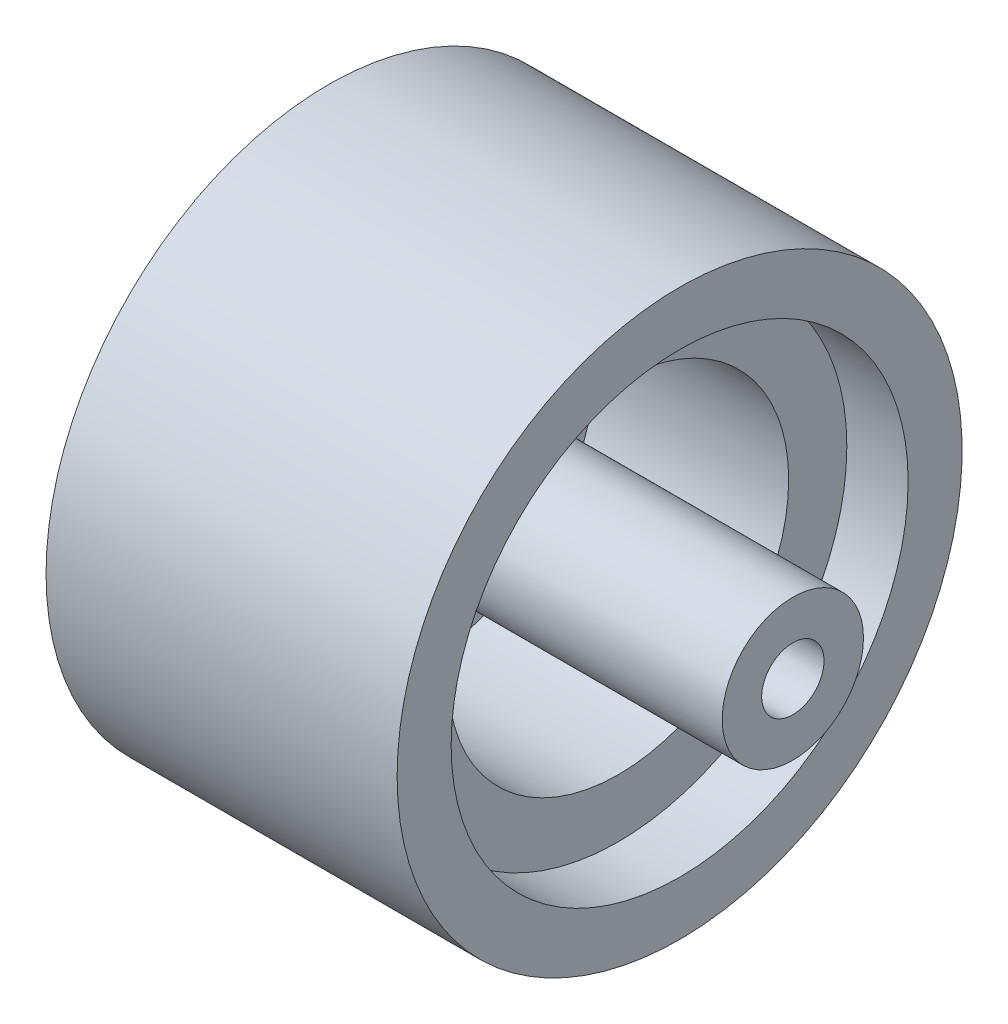
ISO-10303-21;
HEADER;
FILE_DESCRIPTION(('STEP AP214'),'2;1');
FILE_NAME('part.step','',(''),(''),'','','');
FILE_SCHEMA(('AUTOMOTIVE_DESIGN { 1 0 10303 214 1 1 1 1 }'));
ENDSEC;
DATA;
#1=APPLICATION_CONTEXT('core data for automotive mechanical design processes');
#2=APPLICATION_PROTOCOL_DEFINITION('international standard','automotive_design',2000,#1);
#3=PRODUCT_CONTEXT('',#1,'mechanical');
#4=PRODUCT('Part','Part','',(#3));
#5=PRODUCT_RELATED_PRODUCT_CATEGORY('part','',(#4));
#6=PRODUCT_DEFINITION_FORMATION('','',#4);
#7=PRODUCT_DEFINITION_CONTEXT('part definition',#1,'design');
#8=PRODUCT_DEFINITION('design','',#6,#7);
#9=PRODUCT_DEFINITION_SHAPE('','',#8);
#10=(LENGTH_UNIT() NAMED_UNIT(*) SI_UNIT(.MILLI.,.METRE.));
#11=(NAMED_UNIT(*) PLANE_ANGLE_UNIT() SI_UNIT($,.RADIAN.));
#12=(NAMED_UNIT(*) SI_UNIT($,.STERADIAN.) SOLID_ANGLE_UNIT());
#13=UNCERTAINTY_MEASURE_WITH_UNIT(LENGTH_MEASURE(1.E-05),#10,'distance_accuracy_value','');
#14=(GEOMETRIC_REPRESENTATION_CONTEXT(3) GLOBAL_UNCERTAINTY_ASSIGNED_CONTEXT((#13)) GLOBAL_UNIT_ASSIGNED_CONTEXT((#10,
#11,#12)) REPRESENTATION_CONTEXT('',''));
#15=CARTESIAN_POINT('',(0.,0.,0.));
#16=DIRECTION('',(0.,0.,1.));
#17=DIRECTION('',(1.,0.,0.));
#18=AXIS2_PLACEMENT_3D('',#15,#16,#17);
#19=CARTESIAN_POINT('',(11.,0.,0.));
#20=DIRECTION('',(1.,0.,0.));
#21=DIRECTION('',(0.,0.,-1.));
#22=AXIS2_PLACEMENT_3D('',#19,#20,#21);
#23=PLANE('',#22);
#24=CARTESIAN_POINT('',(11.,0.,0.));
#25=DIRECTION('',(1.,0.,0.));
#26=DIRECTION('',(0.,0.,-1.));
#27=AXIS2_PLACEMENT_3D('',#24,#25,#26);
#28=CIRCLE('',#27,8.2);
#29=CARTESIAN_POINT('',(11.,0.,-8.2));
#30=VERTEX_POINT('',#29);
#31=EDGE_CURVE('E42',#30,#30,#28,.T.);
#32=ORIENTED_EDGE('',*,*,#31,.F.);
#33=EDGE_LOOP('',(#32));
#34=FACE_BOUND('',#33,.T.);
#35=CARTESIAN_POINT('',(11.,0.,0.));
#36=DIRECTION('',(1.,0.,0.));
#37=DIRECTION('',(0.,0.,-1.));
#38=AXIS2_PLACEMENT_3D('',#35,#36,#37);
#39=CIRCLE('',#38,11.);
#40=CARTESIAN_POINT('',(11.,0.,-11.));
#41=VERTEX_POINT('',#40);
#42=EDGE_CURVE('E60',#41,#41,#39,.F.);
#43=ORIENTED_EDGE('',*,*,#42,.F.);
#44=EDGE_LOOP('',(#43));
#45=FACE_BOUND('',#44,.T.);
#46=ADVANCED_FACE('F31',(#34,#45),#23,.T.);
#47=CARTESIAN_POINT('',(0.,0.,0.));
#48=DIRECTION('',(1.,0.,0.));
#49=DIRECTION('',(0.,0.,-1.));
#50=AXIS2_PLACEMENT_3D('',#47,#48,#49);
#51=PLANE('',#50);
#52=CARTESIAN_POINT('',(0.,0.,0.));
#53=DIRECTION('',(1.,0.,0.));
#54=DIRECTION('',(0.,0.,-1.));
#55=AXIS2_PLACEMENT_3D('',#52,#53,#54);
#56=CIRCLE('',#55,1.5);
#57=CARTESIAN_POINT('',(0.,0.,-1.5));
#58=VERTEX_POINT('',#57);
#59=EDGE_CURVE('E52',#58,#58,#56,.T.);
#60=ORIENTED_EDGE('',*,*,#59,.T.);
#61=EDGE_LOOP('',(#60));
#62=FACE_BOUND('',#61,.T.);
#63=CARTESIAN_POINT('',(0.,0.,0.));
#64=DIRECTION('',(1.,0.,0.));
#65=DIRECTION('',(0.,0.,-1.));
#66=AXIS2_PLACEMENT_3D('',#63,#64,#65);
#67=CIRCLE('',#66,11.);
#68=CARTESIAN_POINT('',(0.,0.,-11.));
#69=VERTEX_POINT('',#68);
#70=EDGE_CURVE('E10',#69,#69,#67,.T.);
#71=ORIENTED_EDGE('',*,*,#70,.F.);
#72=EDGE_LOOP('',(#71));
#73=FACE_BOUND('',#72,.T.);
#74=ADVANCED_FACE('F33',(#62,#73),#51,.F.);
#75=CARTESIAN_POINT('',(1.65,0.,0.));
#76=DIRECTION('',(1.,0.,0.));
#77=DIRECTION('',(0.,0.,-1.));
#78=AXIS2_PLACEMENT_3D('',#75,#76,#77);
#79=CYLINDRICAL_SURFACE('',#78,8.2);
#80=CARTESIAN_POINT('',(1.65,0.,0.));
#81=DIRECTION('',(1.,0.,0.));
#82=DIRECTION('',(0.,0.,-1.));
#83=AXIS2_PLACEMENT_3D('',#80,#81,#82);
#84=CIRCLE('',#83,8.2);
#85=CARTESIAN_POINT('',(1.65,0.,-8.2));
#86=VERTEX_POINT('',#85);
#87=EDGE_CURVE('E38',#86,#86,#84,.T.);
#88=ORIENTED_EDGE('',*,*,#87,.F.);
#89=EDGE_LOOP('',(#88));
#90=FACE_BOUND('',#89,.T.);
#91=ORIENTED_EDGE('',*,*,#31,.T.);
#92=EDGE_LOOP('',(#91));
#93=FACE_BOUND('',#92,.T.);
#94=ADVANCED_FACE('F102',(#90,#93),#79,.F.);
#95=CARTESIAN_POINT('',(1.65,0.,0.));
#96=DIRECTION('',(1.,0.,0.));
#97=DIRECTION('',(0.,0.,-1.));
#98=AXIS2_PLACEMENT_3D('',#95,#96,#97);
#99=PLANE('',#98);
#100=CARTESIAN_POINT('',(1.65,0.,0.));
#101=DIRECTION('',(1.,0.,0.));
#102=DIRECTION('',(0.,0.,-1.));
#103=AXIS2_PLACEMENT_3D('',#100,#101,#102);
#104=CIRCLE('',#103,3.4);
#105=CARTESIAN_POINT('',(1.65,0.,-3.4));
#106=VERTEX_POINT('',#105);
#107=EDGE_CURVE('E49',#106,#106,#104,.T.);
#108=ORIENTED_EDGE('',*,*,#107,.F.);
#109=EDGE_LOOP('',(#108));
#110=FACE_BOUND('',#109,.T.);
#111=ORIENTED_EDGE('',*,*,#87,.T.);
#112=EDGE_LOOP('',(#111));
#113=FACE_BOUND('',#112,.T.);
#114=ADVANCED_FACE('F109',(#110,#113),#99,.T.);
#115=CARTESIAN_POINT('',(19.4,0.,0.));
#116=DIRECTION('',(-1.,0.,0.));
#117=DIRECTION('',(0.,0.,1.));
#118=AXIS2_PLACEMENT_3D('',#115,#116,#117);
#119=CYLINDRICAL_SURFACE('',#118,3.4);
#120=CARTESIAN_POINT('',(19.4,0.,0.));
#121=DIRECTION('',(1.,0.,0.));
#122=DIRECTION('',(0.,0.,-1.));
#123=AXIS2_PLACEMENT_3D('',#120,#121,#122);
#124=CIRCLE('',#123,3.4);
#125=CARTESIAN_POINT('',(19.4,0.,-3.4));
#126=VERTEX_POINT('',#125);
#127=EDGE_CURVE('E47',#126,#126,#124,.T.);
#128=ORIENTED_EDGE('',*,*,#127,.F.);
#129=EDGE_LOOP('',(#128));
#130=FACE_BOUND('',#129,.T.);
#131=ORIENTED_EDGE('',*,*,#107,.T.);
#132=EDGE_LOOP('',(#131));
#133=FACE_BOUND('',#132,.T.);
#134=ADVANCED_FACE('F113',(#130,#133),#119,.T.);
#135=CARTESIAN_POINT('',(19.4,0.,0.));
#136=DIRECTION('',(1.,0.,0.));
#137=DIRECTION('',(0.,0.,-1.));
#138=AXIS2_PLACEMENT_3D('',#135,#136,#137);
#139=PLANE('',#138);
#140=CARTESIAN_POINT('',(19.4,0.,0.));
#141=DIRECTION('',(1.,0.,0.));
#142=DIRECTION('',(0.,0.,-1.));
#143=AXIS2_PLACEMENT_3D('',#140,#141,#142);
#144=CIRCLE('',#143,1.5);
#145=CARTESIAN_POINT('',(19.4,0.,-1.5));
#146=VERTEX_POINT('',#145);
#147=EDGE_CURVE('E57',#146,#146,#144,.T.);
#148=ORIENTED_EDGE('',*,*,#147,.F.);
#149=EDGE_LOOP('',(#148));
#150=FACE_BOUND('',#149,.T.);
#151=ORIENTED_EDGE('',*,*,#127,.T.);
#152=EDGE_LOOP('',(#151));
#153=FACE_BOUND('',#152,.T.);
#154=ADVANCED_FACE('F117',(#150,#153),#139,.T.);
#155=CARTESIAN_POINT('',(-6.35,0.,0.));
#156=DIRECTION('',(1.,0.,0.));
#157=DIRECTION('',(0.,0.,-1.));
#158=AXIS2_PLACEMENT_3D('',#155,#156,#157);
#159=CYLINDRICAL_SURFACE('',#158,1.5);
#160=ORIENTED_EDGE('',*,*,#147,.T.);
#161=EDGE_LOOP('',(#160));
#162=FACE_BOUND('',#161,.T.);
#163=ORIENTED_EDGE('',*,*,#59,.F.);
#164=EDGE_LOOP('',(#163));
#165=FACE_BOUND('',#164,.T.);
#166=ADVANCED_FACE('F95',(#162,#165),#159,.F.);
#167=CARTESIAN_POINT('',(-2.95,0.,0.));
#168=DIRECTION('',(1.,0.,0.));
#169=DIRECTION('',(0.,0.,-1.));
#170=AXIS2_PLACEMENT_3D('',#167,#168,#169);
#171=CYLINDRICAL_SURFACE('',#170,11.);
#172=CARTESIAN_POINT('',(-2.95,0.,0.));
#173=DIRECTION('',(-1.,0.,0.));
#174=DIRECTION('',(0.,0.,1.));
#175=AXIS2_PLACEMENT_3D('',#172,#173,#174);
#176=CIRCLE('',#175,11.);
#177=CARTESIAN_POINT('',(-2.95,0.,11.));
#178=VERTEX_POINT('',#177);
#179=EDGE_CURVE('E66',#178,#178,#176,.T.);
#180=ORIENTED_EDGE('',*,*,#179,.T.);
#181=EDGE_LOOP('',(#180));
#182=FACE_BOUND('',#181,.T.);
#183=ORIENTED_EDGE('',*,*,#70,.T.);
#184=EDGE_LOOP('',(#183));
#185=FACE_BOUND('',#184,.T.);
#186=ADVANCED_FACE('F84',(#182,#185),#171,.F.);
#187=CARTESIAN_POINT('',(-2.95,0.,0.));
#188=DIRECTION('',(-1.,0.,0.));
#189=DIRECTION('',(0.,0.,1.));
#190=AXIS2_PLACEMENT_3D('',#187,#188,#189);
#191=PLANE('',#190);
#192=CARTESIAN_POINT('',(-2.95,0.,0.));
#193=DIRECTION('',(-1.,0.,0.));
#194=DIRECTION('',(0.,0.,1.));
#195=AXIS2_PLACEMENT_3D('',#192,#193,#194);
#196=CIRCLE('',#195,13.6);
#197=CARTESIAN_POINT('',(-2.95,0.,13.6));
#198=VERTEX_POINT('',#197);
#199=EDGE_CURVE('E63',#198,#198,#196,.T.);
#200=ORIENTED_EDGE('',*,*,#199,.T.);
#201=EDGE_LOOP('',(#200));
#202=FACE_BOUND('',#201,.T.);
#203=ORIENTED_EDGE('',*,*,#179,.F.);
#204=EDGE_LOOP('',(#203));
#205=FACE_BOUND('',#204,.T.);
#206=ADVANCED_FACE('F90',(#202,#205),#191,.T.);
#207=CARTESIAN_POINT('',(-2.95,0.,0.));
#208=DIRECTION('',(1.,0.,0.));
#209=DIRECTION('',(0.,0.,-1.));
#210=AXIS2_PLACEMENT_3D('',#207,#208,#209);
#211=CYLINDRICAL_SURFACE('',#210,13.6);
#212=ORIENTED_EDGE('',*,*,#199,.F.);
#213=EDGE_LOOP('',(#212));
#214=FACE_BOUND('',#213,.T.);
#215=CARTESIAN_POINT('',(13.95,0.,0.));
#216=DIRECTION('',(-1.,0.,0.));
#217=DIRECTION('',(0.,0.,1.));
#218=AXIS2_PLACEMENT_3D('',#215,#216,#217);
#219=CIRCLE('',#218,13.6);
#220=CARTESIAN_POINT('',(13.95,0.,13.6));
#221=VERTEX_POINT('',#220);
#222=EDGE_CURVE('E69',#221,#221,#219,.T.);
#223=ORIENTED_EDGE('',*,*,#222,.T.);
#224=EDGE_LOOP('',(#223));
#225=FACE_BOUND('',#224,.T.);
#226=ADVANCED_FACE('F81',(#214,#225),#211,.T.);
#227=ORIENTED_EDGE('',*,*,#42,.T.);
#228=EDGE_LOOP('',(#227));
#229=FACE_BOUND('',#228,.T.);
#230=CARTESIAN_POINT('',(13.95,0.,0.));
#231=DIRECTION('',(-1.,0.,0.));
#232=DIRECTION('',(0.,0.,1.));
#233=AXIS2_PLACEMENT_3D('',#230,#231,#232);
#234=CIRCLE('',#233,11.);
#235=CARTESIAN_POINT('',(13.95,0.,11.));
#236=VERTEX_POINT('',#235);
#237=EDGE_CURVE('E72',#236,#236,#234,.T.);
#238=ORIENTED_EDGE('',*,*,#237,.F.);
#239=EDGE_LOOP('',(#238));
#240=FACE_BOUND('',#239,.T.);
#241=ADVANCED_FACE('F79',(#229,#240),#171,.F.);
#242=CARTESIAN_POINT('',(13.95,0.,0.));
#243=DIRECTION('',(-1.,0.,0.));
#244=DIRECTION('',(0.,0.,1.));
#245=AXIS2_PLACEMENT_3D('',#242,#243,#244);
#246=PLANE('',#245);
#247=ORIENTED_EDGE('',*,*,#237,.T.);
#248=EDGE_LOOP('',(#247));
#249=FACE_BOUND('',#248,.T.);
#250=ORIENTED_EDGE('',*,*,#222,.F.);
#251=EDGE_LOOP('',(#250));
#252=FACE_BOUND('',#251,.T.);
#253=ADVANCED_FACE('F76',(#249,#252),#246,.F.);
#254=CLOSED_SHELL('',(#46,#74,#94,#114,#134,#154,#166,#186,#206,#226,#241,#253));
#255=MANIFOLD_SOLID_BREP('B2',#254);
#256=ADVANCED_BREP_SHAPE_REPRESENTATION('',(#18,#255),#14);
#257=SHAPE_DEFINITION_REPRESENTATION(#9,#256);
ENDSEC;
END-ISO-10303-21;
